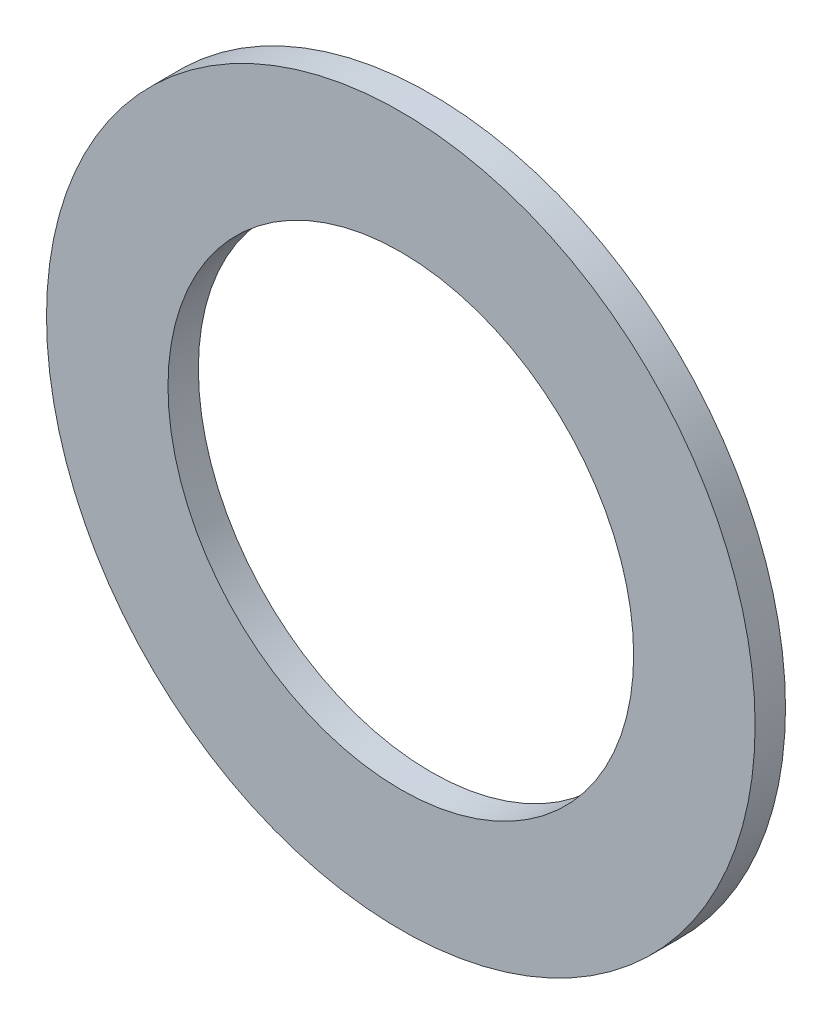
ISO-10303-21;
HEADER;
FILE_DESCRIPTION(('STEP AP214'),'2;1');
FILE_NAME('part.step','',(''),(''),'','','');
FILE_SCHEMA(('AUTOMOTIVE_DESIGN { 1 0 10303 214 1 1 1 1 }'));
ENDSEC;
DATA;
#1=APPLICATION_CONTEXT('core data for automotive mechanical design processes');
#2=APPLICATION_PROTOCOL_DEFINITION('international standard','automotive_design',2000,#1);
#3=PRODUCT_CONTEXT('',#1,'mechanical');
#4=PRODUCT('Part','Part','',(#3));
#5=PRODUCT_RELATED_PRODUCT_CATEGORY('part','',(#4));
#6=PRODUCT_DEFINITION_FORMATION('','',#4);
#7=PRODUCT_DEFINITION_CONTEXT('part definition',#1,'design');
#8=PRODUCT_DEFINITION('design','',#6,#7);
#9=PRODUCT_DEFINITION_SHAPE('','',#8);
#10=(LENGTH_UNIT() NAMED_UNIT(*) SI_UNIT(.MILLI.,.METRE.));
#11=(NAMED_UNIT(*) PLANE_ANGLE_UNIT() SI_UNIT($,.RADIAN.));
#12=(NAMED_UNIT(*) SI_UNIT($,.STERADIAN.) SOLID_ANGLE_UNIT());
#13=UNCERTAINTY_MEASURE_WITH_UNIT(LENGTH_MEASURE(1.E-05),#10,'distance_accuracy_value','');
#14=(GEOMETRIC_REPRESENTATION_CONTEXT(3) GLOBAL_UNCERTAINTY_ASSIGNED_CONTEXT((#13)) GLOBAL_UNIT_ASSIGNED_CONTEXT((#10,
#11,#12)) REPRESENTATION_CONTEXT('',''));
#15=CARTESIAN_POINT('',(0.,0.,0.));
#16=DIRECTION('',(0.,0.,1.));
#17=DIRECTION('',(1.,0.,0.));
#18=AXIS2_PLACEMENT_3D('',#15,#16,#17);
#19=CARTESIAN_POINT('',(-8.77076189453874E-12,8.18789480661053E-12,3.00000000000011));
#20=DIRECTION('',(0.,0.,0.999999999999998));
#21=DIRECTION('',(1.,0.,0.));
#22=AXIS2_PLACEMENT_3D('',#19,#20,#21);
#23=PLANE('',#22);
#24=CARTESIAN_POINT('',(-8.77076189453874E-12,8.18789480661053E-12,3.00000000000011));
#25=DIRECTION('',(0.,0.,0.999999999999998));
#26=DIRECTION('',(1.,0.,0.));
#27=AXIS2_PLACEMENT_3D('',#24,#25,#26);
#28=CIRCLE('',#27,35.);
#29=CARTESIAN_POINT('',(34.9999999999913,8.33166868829949E-12,3.00000000000011));
#30=VERTEX_POINT('',#29);
#31=EDGE_CURVE('E11',#30,#30,#28,.T.);
#32=ORIENTED_EDGE('',*,*,#31,.T.);
#33=EDGE_LOOP('',(#32));
#34=FACE_BOUND('',#33,.T.);
#35=CARTESIAN_POINT('',(-8.77076189453874E-12,8.18789480661053E-12,3.00000000000011));
#36=DIRECTION('',(0.,0.,0.999999999999998));
#37=DIRECTION('',(1.,0.,0.));
#38=AXIS2_PLACEMENT_3D('',#35,#36,#37);
#39=CIRCLE('',#38,23.);
#40=CARTESIAN_POINT('',(22.9999999999912,8.28237478600613E-12,3.00000000000011));
#41=VERTEX_POINT('',#40);
#42=EDGE_CURVE('E56',#41,#41,#39,.T.);
#43=ORIENTED_EDGE('',*,*,#42,.F.);
#44=EDGE_LOOP('',(#43));
#45=FACE_BOUND('',#44,.T.);
#46=ADVANCED_FACE('F41',(#34,#45),#23,.T.);
#47=CARTESIAN_POINT('',(0.,0.,0.));
#48=DIRECTION('',(0.,0.,0.999999999999998));
#49=DIRECTION('',(1.,0.,0.));
#50=AXIS2_PLACEMENT_3D('',#47,#48,#49);
#51=PLANE('',#50);
#52=CARTESIAN_POINT('',(0.,0.,0.));
#53=DIRECTION('',(0.,0.,0.999999999999998));
#54=DIRECTION('',(1.,0.,0.));
#55=AXIS2_PLACEMENT_3D('',#52,#53,#54);
#56=CIRCLE('',#55,35.);
#57=CARTESIAN_POINT('',(35.,1.43773881688958E-13,0.));
#58=VERTEX_POINT('',#57);
#59=EDGE_CURVE('E45',#58,#58,#56,.T.);
#60=ORIENTED_EDGE('',*,*,#59,.F.);
#61=EDGE_LOOP('',(#60));
#62=FACE_BOUND('',#61,.T.);
#63=CARTESIAN_POINT('',(0.,0.,0.));
#64=DIRECTION('',(0.,0.,0.999999999999998));
#65=DIRECTION('',(1.,0.,0.));
#66=AXIS2_PLACEMENT_3D('',#63,#64,#65);
#67=CIRCLE('',#66,23.);
#68=CARTESIAN_POINT('',(23.,0.,0.));
#69=VERTEX_POINT('',#68);
#70=EDGE_CURVE('E59',#69,#69,#67,.T.);
#71=ORIENTED_EDGE('',*,*,#70,.T.);
#72=EDGE_LOOP('',(#71));
#73=FACE_BOUND('',#72,.T.);
#74=ADVANCED_FACE('F74',(#62,#73),#51,.F.);
#75=CARTESIAN_POINT('',(-8.77076189453874E-12,8.18789480661053E-12,3.00000000000011));
#76=DIRECTION('',(0.,0.,-0.999999999999998));
#77=DIRECTION('',(-1.,0.,0.));
#78=AXIS2_PLACEMENT_3D('',#75,#76,#77);
#79=CYLINDRICAL_SURFACE('',#78,35.);
#80=ORIENTED_EDGE('',*,*,#31,.F.);
#81=EDGE_LOOP('',(#80));
#82=FACE_BOUND('',#81,.T.);
#83=ORIENTED_EDGE('',*,*,#59,.T.);
#84=EDGE_LOOP('',(#83));
#85=FACE_BOUND('',#84,.T.);
#86=ADVANCED_FACE('F43',(#82,#85),#79,.T.);
#87=CARTESIAN_POINT('',(-8.77076189453874E-12,8.18789480661053E-12,3.00000000000011));
#88=DIRECTION('',(0.,0.,-0.999999999999998));
#89=DIRECTION('',(-1.,0.,0.));
#90=AXIS2_PLACEMENT_3D('',#87,#88,#89);
#91=CYLINDRICAL_SURFACE('',#90,23.);
#92=ORIENTED_EDGE('',*,*,#42,.T.);
#93=EDGE_LOOP('',(#92));
#94=FACE_BOUND('',#93,.T.);
#95=ORIENTED_EDGE('',*,*,#70,.F.);
#96=EDGE_LOOP('',(#95));
#97=FACE_BOUND('',#96,.T.);
#98=ADVANCED_FACE('F76',(#94,#97),#91,.F.);
#99=CLOSED_SHELL('',(#46,#74,#86,#98));
#100=MANIFOLD_SOLID_BREP('B2',#99);
#101=ADVANCED_BREP_SHAPE_REPRESENTATION('',(#18,#100),#14);
#102=SHAPE_DEFINITION_REPRESENTATION(#9,#101);
ENDSEC;
END-ISO-10303-21;
